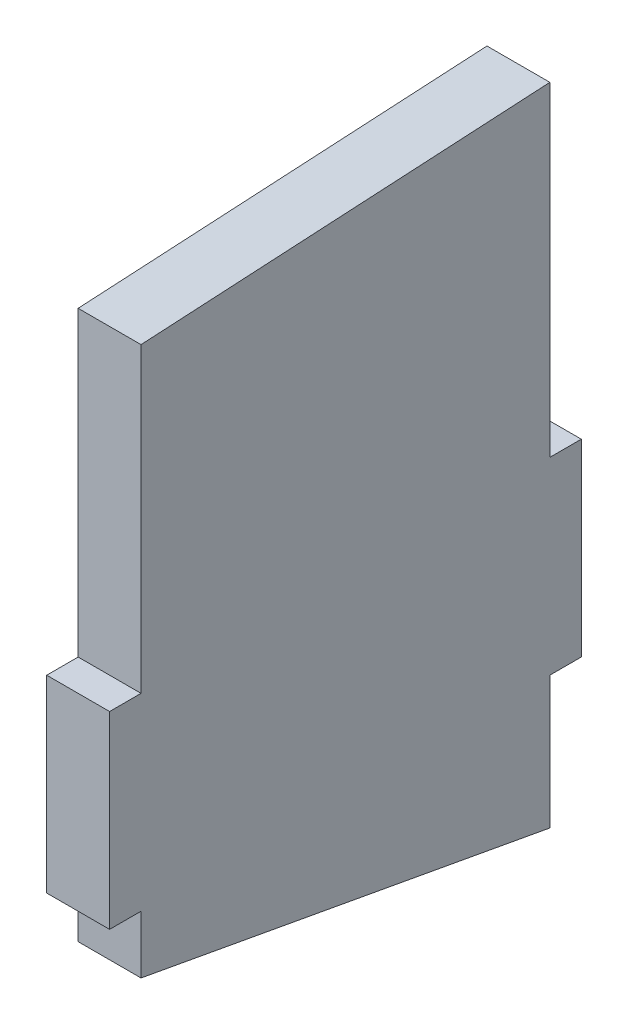
ISO-10303-21;
HEADER;
FILE_DESCRIPTION(('STEP AP214'),'2;1');
FILE_NAME('part.step','',(''),(''),'','','');
FILE_SCHEMA(('AUTOMOTIVE_DESIGN { 1 0 10303 214 1 1 1 1 }'));
ENDSEC;
DATA;
#1=APPLICATION_CONTEXT('core data for automotive mechanical design processes');
#2=APPLICATION_PROTOCOL_DEFINITION('international standard','automotive_design',2000,#1);
#3=PRODUCT_CONTEXT('',#1,'mechanical');
#4=PRODUCT('Part','Part','',(#3));
#5=PRODUCT_RELATED_PRODUCT_CATEGORY('part','',(#4));
#6=PRODUCT_DEFINITION_FORMATION('','',#4);
#7=PRODUCT_DEFINITION_CONTEXT('part definition',#1,'design');
#8=PRODUCT_DEFINITION('design','',#6,#7);
#9=PRODUCT_DEFINITION_SHAPE('','',#8);
#10=(LENGTH_UNIT() NAMED_UNIT(*) SI_UNIT(.MILLI.,.METRE.));
#11=(NAMED_UNIT(*) PLANE_ANGLE_UNIT() SI_UNIT($,.RADIAN.));
#12=(NAMED_UNIT(*) SI_UNIT($,.STERADIAN.) SOLID_ANGLE_UNIT());
#13=UNCERTAINTY_MEASURE_WITH_UNIT(LENGTH_MEASURE(1.E-05),#10,'distance_accuracy_value','');
#14=(GEOMETRIC_REPRESENTATION_CONTEXT(3) GLOBAL_UNCERTAINTY_ASSIGNED_CONTEXT((#13)) GLOBAL_UNIT_ASSIGNED_CONTEXT((#10,
#11,#12)) REPRESENTATION_CONTEXT('',''));
#15=CARTESIAN_POINT('',(0.,0.,0.));
#16=DIRECTION('',(0.,0.,1.));
#17=DIRECTION('',(1.,0.,0.));
#18=AXIS2_PLACEMENT_3D('',#15,#16,#17);
#19=CARTESIAN_POINT('',(25.4,0.,82.55));
#20=DIRECTION('',(0.,0.,1.));
#21=DIRECTION('',(1.,0.,0.));
#22=AXIS2_PLACEMENT_3D('',#19,#20,#21);
#23=PLANE('',#22);
#24=DIRECTION('',(0.,1.,0.));
#25=VECTOR('',#24,1.);
#26=CARTESIAN_POINT('',(0.,0.,82.55));
#27=LINE('',#26,#25);
#28=CARTESIAN_POINT('',(0.,38.1,82.55));
#29=VERTEX_POINT('',#28);
#30=CARTESIAN_POINT('',(0.,160.06891278,82.55));
#31=VERTEX_POINT('',#30);
#32=EDGE_CURVE('E159',#29,#31,#27,.T.);
#33=ORIENTED_EDGE('',*,*,#32,.F.);
#34=DIRECTION('',(-1.,0.,0.));
#35=VECTOR('',#34,1.);
#36=CARTESIAN_POINT('',(25.4,38.1,82.55));
#37=LINE('',#36,#35);
#38=CARTESIAN_POINT('',(25.4,38.1,82.55));
#39=VERTEX_POINT('',#38);
#40=EDGE_CURVE('E11',#39,#29,#37,.T.);
#41=ORIENTED_EDGE('',*,*,#40,.F.);
#42=DIRECTION('',(0.,1.,0.));
#43=VECTOR('',#42,1.);
#44=CARTESIAN_POINT('',(25.4,0.,82.55));
#45=LINE('',#44,#43);
#46=CARTESIAN_POINT('',(25.4,160.06891278,82.55));
#47=VERTEX_POINT('',#46);
#48=EDGE_CURVE('E188',#39,#47,#45,.T.);
#49=ORIENTED_EDGE('',*,*,#48,.T.);
#50=DIRECTION('',(-1.,0.,0.));
#51=VECTOR('',#50,1.);
#52=CARTESIAN_POINT('',(25.4,160.06891278,82.55));
#53=LINE('',#52,#51);
#54=EDGE_CURVE('E57',#47,#31,#53,.T.);
#55=ORIENTED_EDGE('',*,*,#54,.T.);
#56=EDGE_LOOP('',(#33,#41,#49,#55));
#57=FACE_BOUND('',#56,.T.);
#58=ADVANCED_FACE('F41',(#57),#23,.T.);
#59=CARTESIAN_POINT('',(25.4,38.1,0.));
#60=DIRECTION('',(0.,1.,0.));
#61=DIRECTION('',(0.,0.,1.));
#62=AXIS2_PLACEMENT_3D('',#59,#60,#61);
#63=PLANE('',#62);
#64=DIRECTION('',(0.,0.,-1.));
#65=VECTOR('',#64,1.);
#66=CARTESIAN_POINT('',(0.,38.1,0.));
#67=LINE('',#66,#65);
#68=CARTESIAN_POINT('',(0.,38.1,95.25));
#69=VERTEX_POINT('',#68);
#70=EDGE_CURVE('E161',#69,#29,#67,.T.);
#71=ORIENTED_EDGE('',*,*,#70,.F.);
#72=DIRECTION('',(-1.,0.,0.));
#73=VECTOR('',#72,1.);
#74=CARTESIAN_POINT('',(25.4,38.1,95.25));
#75=LINE('',#74,#73);
#76=CARTESIAN_POINT('',(25.4,38.1,95.25));
#77=VERTEX_POINT('',#76);
#78=EDGE_CURVE('E49',#77,#69,#75,.T.);
#79=ORIENTED_EDGE('',*,*,#78,.F.);
#80=DIRECTION('',(0.,0.,-1.));
#81=VECTOR('',#80,1.);
#82=CARTESIAN_POINT('',(25.4,38.1,0.));
#83=LINE('',#82,#81);
#84=EDGE_CURVE('E231',#77,#39,#83,.T.);
#85=ORIENTED_EDGE('',*,*,#84,.T.);
#86=ORIENTED_EDGE('',*,*,#40,.T.);
#87=EDGE_LOOP('',(#71,#79,#85,#86));
#88=FACE_BOUND('',#87,.T.);
#89=ADVANCED_FACE('F216',(#88),#63,.T.);
#90=CARTESIAN_POINT('',(25.4,0.,95.25));
#91=DIRECTION('',(0.,0.,1.));
#92=DIRECTION('',(1.,0.,0.));
#93=AXIS2_PLACEMENT_3D('',#90,#91,#92);
#94=PLANE('',#93);
#95=DIRECTION('',(0.,1.,0.));
#96=VECTOR('',#95,1.);
#97=CARTESIAN_POINT('',(0.,0.,95.25));
#98=LINE('',#97,#96);
#99=CARTESIAN_POINT('',(0.,-38.1,95.25));
#100=VERTEX_POINT('',#99);
#101=EDGE_CURVE('E164',#100,#69,#98,.T.);
#102=ORIENTED_EDGE('',*,*,#101,.F.);
#103=DIRECTION('',(-1.,0.,0.));
#104=VECTOR('',#103,1.);
#105=CARTESIAN_POINT('',(25.4,-38.1,95.25));
#106=LINE('',#105,#104);
#107=CARTESIAN_POINT('',(25.4,-38.1,95.25));
#108=VERTEX_POINT('',#107);
#109=EDGE_CURVE('E205',#108,#100,#106,.T.);
#110=ORIENTED_EDGE('',*,*,#109,.F.);
#111=DIRECTION('',(0.,1.,0.));
#112=VECTOR('',#111,1.);
#113=CARTESIAN_POINT('',(25.4,0.,95.25));
#114=LINE('',#113,#112);
#115=EDGE_CURVE('E212',#108,#77,#114,.T.);
#116=ORIENTED_EDGE('',*,*,#115,.T.);
#117=ORIENTED_EDGE('',*,*,#78,.T.);
#118=EDGE_LOOP('',(#102,#110,#116,#117));
#119=FACE_BOUND('',#118,.T.);
#120=ADVANCED_FACE('F210',(#119),#94,.T.);
#121=CARTESIAN_POINT('',(25.4,-38.1,0.));
#122=DIRECTION('',(0.,1.,0.));
#123=DIRECTION('',(0.,0.,1.));
#124=AXIS2_PLACEMENT_3D('',#121,#122,#123);
#125=PLANE('',#124);
#126=DIRECTION('',(0.,0.,-1.));
#127=VECTOR('',#126,1.);
#128=CARTESIAN_POINT('',(0.,-38.1,0.));
#129=LINE('',#128,#127);
#130=CARTESIAN_POINT('',(0.,-38.1,82.55));
#131=VERTEX_POINT('',#130);
#132=EDGE_CURVE('E167',#100,#131,#129,.T.);
#133=ORIENTED_EDGE('',*,*,#132,.T.);
#134=DIRECTION('',(-1.,0.,0.));
#135=VECTOR('',#134,1.);
#136=CARTESIAN_POINT('',(25.4,-38.1,82.55));
#137=LINE('',#136,#135);
#138=CARTESIAN_POINT('',(25.4,-38.1,82.55));
#139=VERTEX_POINT('',#138);
#140=EDGE_CURVE('E203',#139,#131,#137,.T.);
#141=ORIENTED_EDGE('',*,*,#140,.F.);
#142=DIRECTION('',(0.,0.,-1.));
#143=VECTOR('',#142,1.);
#144=CARTESIAN_POINT('',(25.4,-38.1,0.));
#145=LINE('',#144,#143);
#146=EDGE_CURVE('E227',#108,#139,#145,.T.);
#147=ORIENTED_EDGE('',*,*,#146,.F.);
#148=ORIENTED_EDGE('',*,*,#109,.T.);
#149=EDGE_LOOP('',(#133,#141,#147,#148));
#150=FACE_BOUND('',#149,.T.);
#151=ADVANCED_FACE('F224',(#150),#125,.F.);
#152=CARTESIAN_POINT('',(25.4,0.,82.55));
#153=DIRECTION('',(0.,0.,1.));
#154=DIRECTION('',(1.,0.,0.));
#155=AXIS2_PLACEMENT_3D('',#152,#153,#154);
#156=PLANE('',#155);
#157=DIRECTION('',(0.,1.,0.));
#158=VECTOR('',#157,1.);
#159=CARTESIAN_POINT('',(0.,0.,82.55));
#160=LINE('',#159,#158);
#161=CARTESIAN_POINT('',(0.,-61.45546637,82.55));
#162=VERTEX_POINT('',#161);
#163=EDGE_CURVE('E170',#162,#131,#160,.T.);
#164=ORIENTED_EDGE('',*,*,#163,.F.);
#165=DIRECTION('',(-1.,0.,0.));
#166=VECTOR('',#165,1.);
#167=CARTESIAN_POINT('',(25.4,-61.45546637,82.55));
#168=LINE('',#167,#166);
#169=CARTESIAN_POINT('',(25.4,-61.45546637,82.55));
#170=VERTEX_POINT('',#169);
#171=EDGE_CURVE('E201',#170,#162,#168,.T.);
#172=ORIENTED_EDGE('',*,*,#171,.F.);
#173=DIRECTION('',(0.,1.,0.));
#174=VECTOR('',#173,1.);
#175=CARTESIAN_POINT('',(25.4,0.,82.55));
#176=LINE('',#175,#174);
#177=EDGE_CURVE('E229',#170,#139,#176,.T.);
#178=ORIENTED_EDGE('',*,*,#177,.T.);
#179=ORIENTED_EDGE('',*,*,#140,.T.);
#180=EDGE_LOOP('',(#164,#172,#178,#179));
#181=FACE_BOUND('',#180,.T.);
#182=ADVANCED_FACE('F271',(#181),#156,.T.);
#183=CARTESIAN_POINT('',(25.4,-74.0411110256045,13.4942420599153));
#184=DIRECTION('',(0.,0.983794470792168,-0.179299858446004));
#185=DIRECTION('',(0.,0.179299858446004,0.983794470792169));
#186=AXIS2_PLACEMENT_3D('',#183,#184,#185);
#187=PLANE('',#186);
#188=DIRECTION('',(0.,-0.179299858446004,-0.983794470792169));
#189=VECTOR('',#188,1.);
#190=CARTESIAN_POINT('',(0.,-74.0411110256045,13.4942420599153));
#191=LINE('',#190,#189);
#192=CARTESIAN_POINT('',(0.,-91.545497884,-82.55));
#193=VERTEX_POINT('',#192);
#194=EDGE_CURVE('E173',#162,#193,#191,.T.);
#195=ORIENTED_EDGE('',*,*,#194,.T.);
#196=DIRECTION('',(-1.,0.,0.));
#197=VECTOR('',#196,1.);
#198=CARTESIAN_POINT('',(25.4,-91.545497884,-82.55));
#199=LINE('',#198,#197);
#200=CARTESIAN_POINT('',(25.4,-91.545497884,-82.55));
#201=VERTEX_POINT('',#200);
#202=EDGE_CURVE('E198',#201,#193,#199,.T.);
#203=ORIENTED_EDGE('',*,*,#202,.F.);
#204=DIRECTION('',(0.,-0.179299858446004,-0.983794470792169));
#205=VECTOR('',#204,1.);
#206=CARTESIAN_POINT('',(25.4,-74.0411110256045,13.4942420599153));
#207=LINE('',#206,#205);
#208=EDGE_CURVE('E237',#170,#201,#207,.T.);
#209=ORIENTED_EDGE('',*,*,#208,.F.);
#210=ORIENTED_EDGE('',*,*,#171,.T.);
#211=EDGE_LOOP('',(#195,#203,#209,#210));
#212=FACE_BOUND('',#211,.T.);
#213=ADVANCED_FACE('F274',(#212),#187,.F.);
#214=CARTESIAN_POINT('',(25.4,0.,-82.55));
#215=DIRECTION('',(0.,0.,1.));
#216=DIRECTION('',(1.,0.,0.));
#217=AXIS2_PLACEMENT_3D('',#214,#215,#216);
#218=PLANE('',#217);
#219=DIRECTION('',(0.,1.,0.));
#220=VECTOR('',#219,1.);
#221=CARTESIAN_POINT('',(0.,0.,-82.55));
#222=LINE('',#221,#220);
#223=CARTESIAN_POINT('',(0.,-38.1,-82.55));
#224=VERTEX_POINT('',#223);
#225=EDGE_CURVE('E175',#193,#224,#222,.T.);
#226=ORIENTED_EDGE('',*,*,#225,.T.);
#227=DIRECTION('',(-1.,0.,0.));
#228=VECTOR('',#227,1.);
#229=CARTESIAN_POINT('',(25.4,-38.1,-82.55));
#230=LINE('',#229,#228);
#231=CARTESIAN_POINT('',(25.4,-38.1,-82.55));
#232=VERTEX_POINT('',#231);
#233=EDGE_CURVE('E195',#232,#224,#230,.T.);
#234=ORIENTED_EDGE('',*,*,#233,.F.);
#235=DIRECTION('',(0.,1.,0.));
#236=VECTOR('',#235,1.);
#237=CARTESIAN_POINT('',(25.4,0.,-82.55));
#238=LINE('',#237,#236);
#239=EDGE_CURVE('E239',#201,#232,#238,.T.);
#240=ORIENTED_EDGE('',*,*,#239,.F.);
#241=ORIENTED_EDGE('',*,*,#202,.T.);
#242=EDGE_LOOP('',(#226,#234,#240,#241));
#243=FACE_BOUND('',#242,.T.);
#244=ADVANCED_FACE('F278',(#243),#218,.F.);
#245=CARTESIAN_POINT('',(25.4,-38.1,0.));
#246=DIRECTION('',(0.,1.,0.));
#247=DIRECTION('',(0.,0.,1.));
#248=AXIS2_PLACEMENT_3D('',#245,#246,#247);
#249=PLANE('',#248);
#250=DIRECTION('',(0.,0.,-1.));
#251=VECTOR('',#250,1.);
#252=CARTESIAN_POINT('',(0.,-38.1,0.));
#253=LINE('',#252,#251);
#254=CARTESIAN_POINT('',(0.,-38.1,-95.25));
#255=VERTEX_POINT('',#254);
#256=EDGE_CURVE('E177',#224,#255,#253,.T.);
#257=ORIENTED_EDGE('',*,*,#256,.T.);
#258=DIRECTION('',(-1.,0.,0.));
#259=VECTOR('',#258,1.);
#260=CARTESIAN_POINT('',(25.4,-38.1,-95.25));
#261=LINE('',#260,#259);
#262=CARTESIAN_POINT('',(25.4,-38.1,-95.25));
#263=VERTEX_POINT('',#262);
#264=EDGE_CURVE('E192',#263,#255,#261,.T.);
#265=ORIENTED_EDGE('',*,*,#264,.F.);
#266=DIRECTION('',(0.,0.,-1.));
#267=VECTOR('',#266,1.);
#268=CARTESIAN_POINT('',(25.4,-38.1,0.));
#269=LINE('',#268,#267);
#270=EDGE_CURVE('E154',#232,#263,#269,.T.);
#271=ORIENTED_EDGE('',*,*,#270,.F.);
#272=ORIENTED_EDGE('',*,*,#233,.T.);
#273=EDGE_LOOP('',(#257,#265,#271,#272));
#274=FACE_BOUND('',#273,.T.);
#275=ADVANCED_FACE('F245',(#274),#249,.F.);
#276=CARTESIAN_POINT('',(25.4,0.,-95.25));
#277=DIRECTION('',(0.,0.,1.));
#278=DIRECTION('',(1.,0.,0.));
#279=AXIS2_PLACEMENT_3D('',#276,#277,#278);
#280=PLANE('',#279);
#281=DIRECTION('',(0.,1.,0.));
#282=VECTOR('',#281,1.);
#283=CARTESIAN_POINT('',(0.,0.,-95.25));
#284=LINE('',#283,#282);
#285=CARTESIAN_POINT('',(0.,38.1,-95.25));
#286=VERTEX_POINT('',#285);
#287=EDGE_CURVE('E179',#255,#286,#284,.T.);
#288=ORIENTED_EDGE('',*,*,#287,.T.);
#289=DIRECTION('',(-1.,0.,0.));
#290=VECTOR('',#289,1.);
#291=CARTESIAN_POINT('',(25.4,38.1,-95.25));
#292=LINE('',#291,#290);
#293=CARTESIAN_POINT('',(25.4,38.1,-95.25));
#294=VERTEX_POINT('',#293);
#295=EDGE_CURVE('E141',#294,#286,#292,.T.);
#296=ORIENTED_EDGE('',*,*,#295,.F.);
#297=DIRECTION('',(0.,1.,0.));
#298=VECTOR('',#297,1.);
#299=CARTESIAN_POINT('',(25.4,0.,-95.25));
#300=LINE('',#299,#298);
#301=EDGE_CURVE('E151',#263,#294,#300,.T.);
#302=ORIENTED_EDGE('',*,*,#301,.F.);
#303=ORIENTED_EDGE('',*,*,#264,.T.);
#304=EDGE_LOOP('',(#288,#296,#302,#303));
#305=FACE_BOUND('',#304,.T.);
#306=ADVANCED_FACE('F249',(#305),#280,.F.);
#307=CARTESIAN_POINT('',(25.4,38.1,0.));
#308=DIRECTION('',(0.,1.,0.));
#309=DIRECTION('',(0.,0.,1.));
#310=AXIS2_PLACEMENT_3D('',#307,#308,#309);
#311=PLANE('',#310);
#312=DIRECTION('',(0.,0.,-1.));
#313=VECTOR('',#312,1.);
#314=CARTESIAN_POINT('',(0.,38.1,0.));
#315=LINE('',#314,#313);
#316=CARTESIAN_POINT('',(0.,38.1,-82.55));
#317=VERTEX_POINT('',#316);
#318=EDGE_CURVE('E138',#317,#286,#315,.T.);
#319=ORIENTED_EDGE('',*,*,#318,.F.);
#320=DIRECTION('',(-1.,0.,0.));
#321=VECTOR('',#320,1.);
#322=CARTESIAN_POINT('',(25.4,38.1,-82.55));
#323=LINE('',#322,#321);
#324=CARTESIAN_POINT('',(25.4,38.1,-82.55));
#325=VERTEX_POINT('',#324);
#326=EDGE_CURVE('E132',#325,#317,#323,.T.);
#327=ORIENTED_EDGE('',*,*,#326,.F.);
#328=DIRECTION('',(0.,0.,-1.));
#329=VECTOR('',#328,1.);
#330=CARTESIAN_POINT('',(25.4,38.1,0.));
#331=LINE('',#330,#329);
#332=EDGE_CURVE('E136',#325,#294,#331,.T.);
#333=ORIENTED_EDGE('',*,*,#332,.T.);
#334=ORIENTED_EDGE('',*,*,#295,.T.);
#335=EDGE_LOOP('',(#319,#327,#333,#334));
#336=FACE_BOUND('',#335,.T.);
#337=ADVANCED_FACE('F134',(#336),#311,.T.);
#338=CARTESIAN_POINT('',(25.4,0.,-82.55));
#339=DIRECTION('',(0.,0.,1.));
#340=DIRECTION('',(1.,0.,0.));
#341=AXIS2_PLACEMENT_3D('',#338,#339,#340);
#342=PLANE('',#341);
#343=DIRECTION('',(0.,1.,0.));
#344=VECTOR('',#343,1.);
#345=CARTESIAN_POINT('',(0.,0.,-82.55));
#346=LINE('',#345,#344);
#347=CARTESIAN_POINT('',(0.,169.255785694,-82.55));
#348=VERTEX_POINT('',#347);
#349=EDGE_CURVE('E183',#317,#348,#346,.T.);
#350=ORIENTED_EDGE('',*,*,#349,.T.);
#351=DIRECTION('',(-1.,0.,0.));
#352=VECTOR('',#351,1.);
#353=CARTESIAN_POINT('',(25.4,169.255785694,-82.55));
#354=LINE('',#353,#352);
#355=CARTESIAN_POINT('',(25.4,169.255785694,-82.55));
#356=VERTEX_POINT('',#355);
#357=EDGE_CURVE('E95',#356,#348,#354,.T.);
#358=ORIENTED_EDGE('',*,*,#357,.F.);
#359=DIRECTION('',(0.,1.,0.));
#360=VECTOR('',#359,1.);
#361=CARTESIAN_POINT('',(25.4,0.,-82.55));
#362=LINE('',#361,#360);
#363=EDGE_CURVE('E143',#325,#356,#362,.T.);
#364=ORIENTED_EDGE('',*,*,#363,.F.);
#365=ORIENTED_EDGE('',*,*,#326,.T.);
#366=EDGE_LOOP('',(#350,#358,#364,#365));
#367=FACE_BOUND('',#366,.T.);
#368=ADVANCED_FACE('F144',(#367),#342,.F.);
#369=CARTESIAN_POINT('',(25.4,164.154081018107,9.13423792021688));
#370=DIRECTION('',(0.,0.998455442153425,0.0555583480154766));
#371=DIRECTION('',(0.,-0.0555583480154767,0.998455442153425));
#372=AXIS2_PLACEMENT_3D('',#369,#370,#371);
#373=PLANE('',#372);
#374=DIRECTION('',(0.,0.0555583480154766,-0.998455442153425));
#375=VECTOR('',#374,1.);
#376=CARTESIAN_POINT('',(0.,164.154081018107,9.13423792021688));
#377=LINE('',#376,#375);
#378=EDGE_CURVE('E185',#31,#348,#377,.T.);
#379=ORIENTED_EDGE('',*,*,#378,.F.);
#380=ORIENTED_EDGE('',*,*,#54,.F.);
#381=DIRECTION('',(0.,0.0555583480154766,-0.998455442153425));
#382=VECTOR('',#381,1.);
#383=CARTESIAN_POINT('',(25.4,164.154081018107,9.13423792021688));
#384=LINE('',#383,#382);
#385=EDGE_CURVE('E147',#47,#356,#384,.T.);
#386=ORIENTED_EDGE('',*,*,#385,.T.);
#387=ORIENTED_EDGE('',*,*,#357,.T.);
#388=EDGE_LOOP('',(#379,#380,#386,#387));
#389=FACE_BOUND('',#388,.T.);
#390=ADVANCED_FACE('F250',(#389),#373,.T.);
#391=CARTESIAN_POINT('',(25.4,0.,0.));
#392=DIRECTION('',(1.,0.,0.));
#393=DIRECTION('',(0.,0.,-1.));
#394=AXIS2_PLACEMENT_3D('',#391,#392,#393);
#395=PLANE('',#394);
#396=ORIENTED_EDGE('',*,*,#48,.F.);
#397=ORIENTED_EDGE('',*,*,#84,.F.);
#398=ORIENTED_EDGE('',*,*,#115,.F.);
#399=ORIENTED_EDGE('',*,*,#146,.T.);
#400=ORIENTED_EDGE('',*,*,#177,.F.);
#401=ORIENTED_EDGE('',*,*,#208,.T.);
#402=ORIENTED_EDGE('',*,*,#239,.T.);
#403=ORIENTED_EDGE('',*,*,#270,.T.);
#404=ORIENTED_EDGE('',*,*,#301,.T.);
#405=ORIENTED_EDGE('',*,*,#332,.F.);
#406=ORIENTED_EDGE('',*,*,#363,.T.);
#407=ORIENTED_EDGE('',*,*,#385,.F.);
#408=EDGE_LOOP('',(#396,#397,#398,#399,#400,#401,#402,#403,#404,#405,#406,#407));
#409=FACE_BOUND('',#408,.T.);
#410=ADVANCED_FACE('F149',(#409),#395,.T.);
#411=CARTESIAN_POINT('',(0.,0.,0.));
#412=DIRECTION('',(1.,0.,0.));
#413=DIRECTION('',(0.,0.,-1.));
#414=AXIS2_PLACEMENT_3D('',#411,#412,#413);
#415=PLANE('',#414);
#416=ORIENTED_EDGE('',*,*,#32,.T.);
#417=ORIENTED_EDGE('',*,*,#378,.T.);
#418=ORIENTED_EDGE('',*,*,#349,.F.);
#419=ORIENTED_EDGE('',*,*,#318,.T.);
#420=ORIENTED_EDGE('',*,*,#287,.F.);
#421=ORIENTED_EDGE('',*,*,#256,.F.);
#422=ORIENTED_EDGE('',*,*,#225,.F.);
#423=ORIENTED_EDGE('',*,*,#194,.F.);
#424=ORIENTED_EDGE('',*,*,#163,.T.);
#425=ORIENTED_EDGE('',*,*,#132,.F.);
#426=ORIENTED_EDGE('',*,*,#101,.T.);
#427=ORIENTED_EDGE('',*,*,#70,.T.);
#428=EDGE_LOOP('',(#416,#417,#418,#419,#420,#421,#422,#423,#424,#425,#426,#427));
#429=FACE_BOUND('',#428,.T.);
#430=ADVANCED_FACE('F219',(#429),#415,.F.);
#431=CLOSED_SHELL('',(#58,#89,#120,#151,#182,#213,#244,#275,#306,#337,#368,#390,#410,#430));
#432=MANIFOLD_SOLID_BREP('B2',#431);
#433=ADVANCED_BREP_SHAPE_REPRESENTATION('',(#18,#432),#14);
#434=SHAPE_DEFINITION_REPRESENTATION(#9,#433);
ENDSEC;
END-ISO-10303-21;
